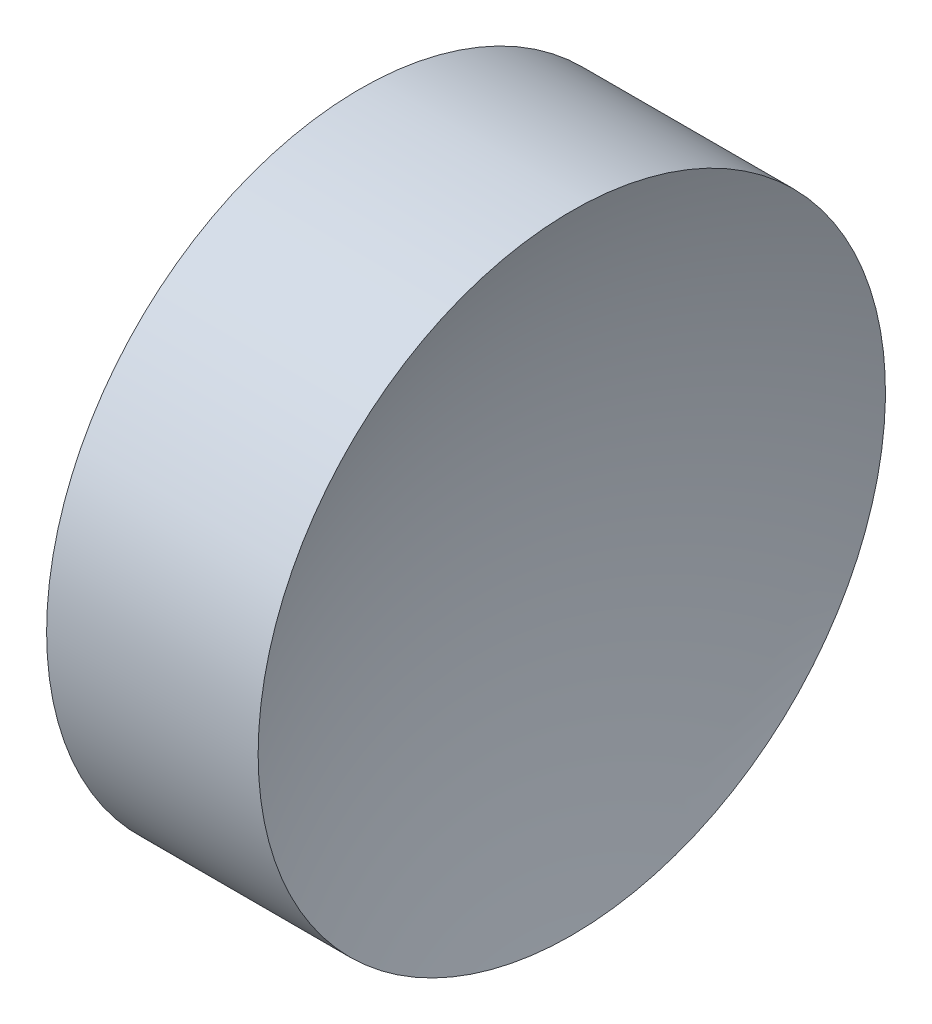
ISO-10303-21;
HEADER;
FILE_DESCRIPTION(('STEP AP214'),'2;1');
FILE_NAME('part.step','',(''),(''),'','','');
FILE_SCHEMA(('AUTOMOTIVE_DESIGN { 1 0 10303 214 1 1 1 1 }'));
ENDSEC;
DATA;
#1=APPLICATION_CONTEXT('core data for automotive mechanical design processes');
#2=APPLICATION_PROTOCOL_DEFINITION('international standard','automotive_design',2000,#1);
#3=PRODUCT_CONTEXT('',#1,'mechanical');
#4=PRODUCT('Part','Part','',(#3));
#5=PRODUCT_RELATED_PRODUCT_CATEGORY('part','',(#4));
#6=PRODUCT_DEFINITION_FORMATION('','',#4);
#7=PRODUCT_DEFINITION_CONTEXT('part definition',#1,'design');
#8=PRODUCT_DEFINITION('design','',#6,#7);
#9=PRODUCT_DEFINITION_SHAPE('','',#8);
#10=(LENGTH_UNIT() NAMED_UNIT(*) SI_UNIT(.MILLI.,.METRE.));
#11=(NAMED_UNIT(*) PLANE_ANGLE_UNIT() SI_UNIT($,.RADIAN.));
#12=(NAMED_UNIT(*) SI_UNIT($,.STERADIAN.) SOLID_ANGLE_UNIT());
#13=UNCERTAINTY_MEASURE_WITH_UNIT(LENGTH_MEASURE(1.E-05),#10,'distance_accuracy_value','');
#14=(GEOMETRIC_REPRESENTATION_CONTEXT(3) GLOBAL_UNCERTAINTY_ASSIGNED_CONTEXT((#13)) GLOBAL_UNIT_ASSIGNED_CONTEXT((#10,
#11,#12)) REPRESENTATION_CONTEXT('',''));
#15=CARTESIAN_POINT('',(0.,0.,0.));
#16=DIRECTION('',(0.,0.,1.));
#17=DIRECTION('',(1.,0.,0.));
#18=AXIS2_PLACEMENT_3D('',#15,#16,#17);
#19=CARTESIAN_POINT('',(32.0692688325745,13.031126091403,0.));
#20=DIRECTION('',(-1.,0.,0.));
#21=DIRECTION('',(0.,-1.,0.));
#22=AXIS2_PLACEMENT_3D('',#19,#20,#21);
#23=SPHERICAL_SURFACE('',#22,8.26);
#24=CARTESIAN_POINT('',(24.4334912035442,13.031126091403,0.));
#25=DIRECTION('',(-1.,0.,0.));
#26=DIRECTION('',(0.,0.,1.));
#27=AXIS2_PLACEMENT_3D('',#24,#25,#26);
#28=CIRCLE('',#27,3.15);
#29=CARTESIAN_POINT('',(24.4334912035442,13.031126091403,3.15));
#30=VERTEX_POINT('',#29);
#31=EDGE_CURVE('E10',#30,#30,#28,.T.);
#32=ORIENTED_EDGE('',*,*,#31,.F.);
#33=EDGE_LOOP('',(#32));
#34=FACE_BOUND('',#33,.T.);
#35=ADVANCED_FACE('F35',(#34),#23,.F.);
#36=CARTESIAN_POINT('',(20.6840306351329,13.031126091403,0.));
#37=DIRECTION('',(-1.,0.,0.));
#38=DIRECTION('',(0.,0.,1.));
#39=AXIS2_PLACEMENT_3D('',#36,#37,#38);
#40=CYLINDRICAL_SURFACE('',#39,3.15);
#41=CARTESIAN_POINT('',(22.3092688325745,13.031126091403,0.));
#42=DIRECTION('',(-1.,0.,0.));
#43=DIRECTION('',(0.,0.,1.));
#44=AXIS2_PLACEMENT_3D('',#41,#42,#43);
#45=CIRCLE('',#44,3.15);
#46=CARTESIAN_POINT('',(22.3092688325745,13.031126091403,3.15));
#47=VERTEX_POINT('',#46);
#48=EDGE_CURVE('E41',#47,#47,#45,.T.);
#49=ORIENTED_EDGE('',*,*,#48,.F.);
#50=EDGE_LOOP('',(#49));
#51=FACE_BOUND('',#50,.T.);
#52=ORIENTED_EDGE('',*,*,#31,.T.);
#53=EDGE_LOOP('',(#52));
#54=FACE_BOUND('',#53,.T.);
#55=ADVANCED_FACE('F49',(#51,#54),#40,.T.);
#56=CARTESIAN_POINT('',(22.3092688325745,13.031126091403,0.));
#57=DIRECTION('',(1.,0.,0.));
#58=DIRECTION('',(0.,0.,-1.));
#59=AXIS2_PLACEMENT_3D('',#56,#57,#58);
#60=PLANE('',#59);
#61=ORIENTED_EDGE('',*,*,#48,.T.);
#62=EDGE_LOOP('',(#61));
#63=FACE_BOUND('',#62,.T.);
#64=ADVANCED_FACE('F47',(#63),#60,.F.);
#65=CLOSED_SHELL('',(#35,#55,#64));
#66=MANIFOLD_SOLID_BREP('B2',#65);
#67=ADVANCED_BREP_SHAPE_REPRESENTATION('',(#18,#66),#14);
#68=SHAPE_DEFINITION_REPRESENTATION(#9,#67);
ENDSEC;
END-ISO-10303-21;
